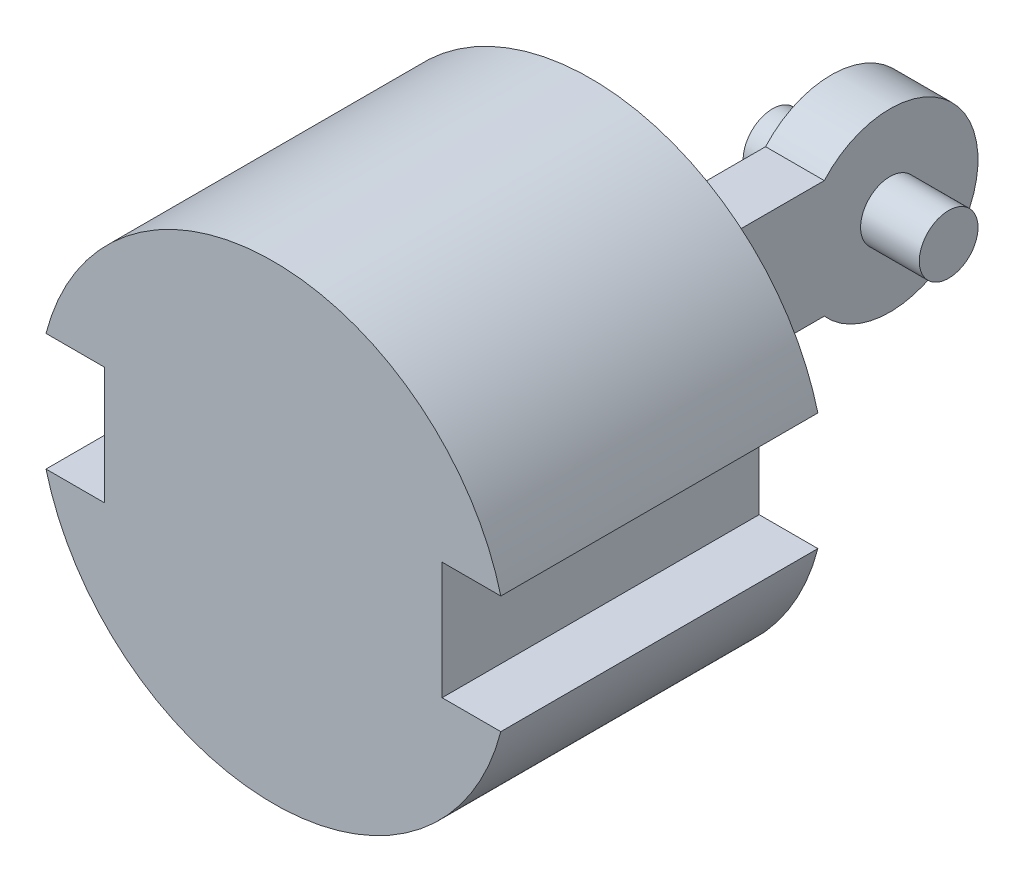
ISO-10303-21;
HEADER;
FILE_DESCRIPTION(('STEP AP214'),'2;1');
FILE_NAME('part.step','',(''),(''),'','','');
FILE_SCHEMA(('AUTOMOTIVE_DESIGN { 1 0 10303 214 1 1 1 1 }'));
ENDSEC;
DATA;
#1=APPLICATION_CONTEXT('core data for automotive mechanical design processes');
#2=APPLICATION_PROTOCOL_DEFINITION('international standard','automotive_design',2000,#1);
#3=PRODUCT_CONTEXT('',#1,'mechanical');
#4=PRODUCT('Part','Part','',(#3));
#5=PRODUCT_RELATED_PRODUCT_CATEGORY('part','',(#4));
#6=PRODUCT_DEFINITION_FORMATION('','',#4);
#7=PRODUCT_DEFINITION_CONTEXT('part definition',#1,'design');
#8=PRODUCT_DEFINITION('design','',#6,#7);
#9=PRODUCT_DEFINITION_SHAPE('','',#8);
#10=(LENGTH_UNIT() NAMED_UNIT(*) SI_UNIT(.MILLI.,.METRE.));
#11=(NAMED_UNIT(*) PLANE_ANGLE_UNIT() SI_UNIT($,.RADIAN.));
#12=(NAMED_UNIT(*) SI_UNIT($,.STERADIAN.) SOLID_ANGLE_UNIT());
#13=UNCERTAINTY_MEASURE_WITH_UNIT(LENGTH_MEASURE(1.E-05),#10,'distance_accuracy_value','');
#14=(GEOMETRIC_REPRESENTATION_CONTEXT(3) GLOBAL_UNCERTAINTY_ASSIGNED_CONTEXT((#13)) GLOBAL_UNIT_ASSIGNED_CONTEXT((#10,
#11,#12)) REPRESENTATION_CONTEXT('',''));
#15=CARTESIAN_POINT('',(0.,0.,0.));
#16=DIRECTION('',(0.,0.,1.));
#17=DIRECTION('',(1.,0.,0.));
#18=AXIS2_PLACEMENT_3D('',#15,#16,#17);
#19=CARTESIAN_POINT('',(0.,0.,68.58));
#20=DIRECTION('',(0.,0.,-1.));
#21=DIRECTION('',(-1.,0.,0.));
#22=AXIS2_PLACEMENT_3D('',#19,#20,#21);
#23=CYLINDRICAL_SURFACE('',#22,50.8);
#24=CARTESIAN_POINT('',(0.,0.,0.));
#25=DIRECTION('',(0.,0.,1.));
#26=DIRECTION('',(1.,0.,0.));
#27=AXIS2_PLACEMENT_3D('',#24,#25,#26);
#28=CIRCLE('',#27,50.8);
#29=CARTESIAN_POINT('',(49.1868884968342,12.7,0.));
#30=VERTEX_POINT('',#29);
#31=CARTESIAN_POINT('',(-49.1868884968342,12.7,0.));
#32=VERTEX_POINT('',#31);
#33=EDGE_CURVE('E140',#30,#32,#28,.T.);
#34=ORIENTED_EDGE('',*,*,#33,.T.);
#35=DIRECTION('',(0.,0.,-1.));
#36=VECTOR('',#35,1.);
#37=CARTESIAN_POINT('',(-49.1868884968342,12.7,68.58));
#38=LINE('',#37,#36);
#39=CARTESIAN_POINT('',(-49.1868884968342,12.7,68.58));
#40=VERTEX_POINT('',#39);
#41=EDGE_CURVE('E11',#40,#32,#38,.T.);
#42=ORIENTED_EDGE('',*,*,#41,.F.);
#43=CARTESIAN_POINT('',(0.,0.,68.58));
#44=DIRECTION('',(0.,0.,1.));
#45=DIRECTION('',(1.,0.,0.));
#46=AXIS2_PLACEMENT_3D('',#43,#44,#45);
#47=CIRCLE('',#46,50.8);
#48=CARTESIAN_POINT('',(49.1868884968342,12.7,68.58));
#49=VERTEX_POINT('',#48);
#50=EDGE_CURVE('E162',#49,#40,#47,.T.);
#51=ORIENTED_EDGE('',*,*,#50,.F.);
#52=DIRECTION('',(0.,0.,-1.));
#53=VECTOR('',#52,1.);
#54=CARTESIAN_POINT('',(49.1868884968342,12.7,68.58));
#55=LINE('',#54,#53);
#56=EDGE_CURVE('E180',#49,#30,#55,.T.);
#57=ORIENTED_EDGE('',*,*,#56,.T.);
#58=EDGE_LOOP('',(#34,#42,#51,#57));
#59=FACE_BOUND('',#58,.T.);
#60=ADVANCED_FACE('F34',(#59),#23,.T.);
#61=CARTESIAN_POINT('',(-49.1868884968342,12.7,68.58));
#62=DIRECTION('',(0.,1.,0.));
#63=DIRECTION('',(-1.,0.,0.));
#64=AXIS2_PLACEMENT_3D('',#61,#62,#63);
#65=PLANE('',#64);
#66=DIRECTION('',(1.,0.,0.));
#67=VECTOR('',#66,1.);
#68=CARTESIAN_POINT('',(-49.1868884968342,12.7,0.));
#69=LINE('',#68,#67);
#70=CARTESIAN_POINT('',(-36.4868884968342,12.7,0.));
#71=VERTEX_POINT('',#70);
#72=EDGE_CURVE('E183',#32,#71,#69,.T.);
#73=ORIENTED_EDGE('',*,*,#72,.T.);
#74=DIRECTION('',(0.,0.,-1.));
#75=VECTOR('',#74,1.);
#76=CARTESIAN_POINT('',(-36.4868884968342,12.7,68.58));
#77=LINE('',#76,#75);
#78=CARTESIAN_POINT('',(-36.4868884968342,12.7,68.58));
#79=VERTEX_POINT('',#78);
#80=EDGE_CURVE('E41',#79,#71,#77,.T.);
#81=ORIENTED_EDGE('',*,*,#80,.F.);
#82=DIRECTION('',(1.,0.,0.));
#83=VECTOR('',#82,1.);
#84=CARTESIAN_POINT('',(-49.1868884968342,12.7,68.58));
#85=LINE('',#84,#83);
#86=EDGE_CURVE('E165',#40,#79,#85,.T.);
#87=ORIENTED_EDGE('',*,*,#86,.F.);
#88=ORIENTED_EDGE('',*,*,#41,.T.);
#89=EDGE_LOOP('',(#73,#81,#87,#88));
#90=FACE_BOUND('',#89,.T.);
#91=ADVANCED_FACE('F240',(#90),#65,.F.);
#92=CARTESIAN_POINT('',(-36.4868884968342,12.7,68.58));
#93=DIRECTION('',(1.,0.,0.));
#94=DIRECTION('',(0.,0.,-1.));
#95=AXIS2_PLACEMENT_3D('',#92,#93,#94);
#96=PLANE('',#95);
#97=DIRECTION('',(0.,-1.,0.));
#98=VECTOR('',#97,1.);
#99=CARTESIAN_POINT('',(-36.4868884968342,12.7,0.));
#100=LINE('',#99,#98);
#101=CARTESIAN_POINT('',(-36.4868884968342,-12.7,0.));
#102=VERTEX_POINT('',#101);
#103=EDGE_CURVE('E185',#71,#102,#100,.T.);
#104=ORIENTED_EDGE('',*,*,#103,.T.);
#105=DIRECTION('',(0.,0.,-1.));
#106=VECTOR('',#105,1.);
#107=CARTESIAN_POINT('',(-36.4868884968342,-12.7,68.58));
#108=LINE('',#107,#106);
#109=CARTESIAN_POINT('',(-36.4868884968342,-12.7,68.58));
#110=VERTEX_POINT('',#109);
#111=EDGE_CURVE('E210',#110,#102,#108,.T.);
#112=ORIENTED_EDGE('',*,*,#111,.F.);
#113=DIRECTION('',(0.,-1.,0.));
#114=VECTOR('',#113,1.);
#115=CARTESIAN_POINT('',(-36.4868884968342,12.7,68.58));
#116=LINE('',#115,#114);
#117=EDGE_CURVE('E168',#79,#110,#116,.T.);
#118=ORIENTED_EDGE('',*,*,#117,.F.);
#119=ORIENTED_EDGE('',*,*,#80,.T.);
#120=EDGE_LOOP('',(#104,#112,#118,#119));
#121=FACE_BOUND('',#120,.T.);
#122=ADVANCED_FACE('F217',(#121),#96,.F.);
#123=CARTESIAN_POINT('',(-36.4868884968342,-12.7,68.58));
#124=DIRECTION('',(0.,-1.,0.));
#125=DIRECTION('',(1.,0.,0.));
#126=AXIS2_PLACEMENT_3D('',#123,#124,#125);
#127=PLANE('',#126);
#128=DIRECTION('',(-1.,0.,0.));
#129=VECTOR('',#128,1.);
#130=CARTESIAN_POINT('',(-36.4868884968342,-12.7,0.));
#131=LINE('',#130,#129);
#132=CARTESIAN_POINT('',(-49.1868884968342,-12.7,0.));
#133=VERTEX_POINT('',#132);
#134=EDGE_CURVE('E187',#102,#133,#131,.T.);
#135=ORIENTED_EDGE('',*,*,#134,.T.);
#136=DIRECTION('',(0.,0.,-1.));
#137=VECTOR('',#136,1.);
#138=CARTESIAN_POINT('',(-49.1868884968342,-12.7,68.58));
#139=LINE('',#138,#137);
#140=CARTESIAN_POINT('',(-49.1868884968342,-12.7,68.58));
#141=VERTEX_POINT('',#140);
#142=EDGE_CURVE('E207',#141,#133,#139,.T.);
#143=ORIENTED_EDGE('',*,*,#142,.F.);
#144=DIRECTION('',(-1.,0.,0.));
#145=VECTOR('',#144,1.);
#146=CARTESIAN_POINT('',(-36.4868884968342,-12.7,68.58));
#147=LINE('',#146,#145);
#148=EDGE_CURVE('E170',#110,#141,#147,.T.);
#149=ORIENTED_EDGE('',*,*,#148,.F.);
#150=ORIENTED_EDGE('',*,*,#111,.T.);
#151=EDGE_LOOP('',(#135,#143,#149,#150));
#152=FACE_BOUND('',#151,.T.);
#153=ADVANCED_FACE('F228',(#152),#127,.F.);
#154=CARTESIAN_POINT('',(0.,0.,68.58));
#155=DIRECTION('',(0.,0.,-1.));
#156=DIRECTION('',(-1.,0.,0.));
#157=AXIS2_PLACEMENT_3D('',#154,#155,#156);
#158=CYLINDRICAL_SURFACE('',#157,50.8);
#159=CARTESIAN_POINT('',(0.,0.,0.));
#160=DIRECTION('',(0.,0.,1.));
#161=DIRECTION('',(1.,0.,0.));
#162=AXIS2_PLACEMENT_3D('',#159,#160,#161);
#163=CIRCLE('',#162,50.8);
#164=CARTESIAN_POINT('',(49.1868884968342,-12.7,0.));
#165=VERTEX_POINT('',#164);
#166=EDGE_CURVE('E189',#133,#165,#163,.T.);
#167=ORIENTED_EDGE('',*,*,#166,.T.);
#168=DIRECTION('',(0.,0.,-1.));
#169=VECTOR('',#168,1.);
#170=CARTESIAN_POINT('',(49.1868884968342,-12.7,68.58));
#171=LINE('',#170,#169);
#172=CARTESIAN_POINT('',(49.1868884968342,-12.7,68.58));
#173=VERTEX_POINT('',#172);
#174=EDGE_CURVE('E204',#173,#165,#171,.T.);
#175=ORIENTED_EDGE('',*,*,#174,.F.);
#176=CARTESIAN_POINT('',(0.,0.,68.58));
#177=DIRECTION('',(0.,0.,1.));
#178=DIRECTION('',(1.,0.,0.));
#179=AXIS2_PLACEMENT_3D('',#176,#177,#178);
#180=CIRCLE('',#179,50.8);
#181=EDGE_CURVE('E172',#141,#173,#180,.T.);
#182=ORIENTED_EDGE('',*,*,#181,.F.);
#183=ORIENTED_EDGE('',*,*,#142,.T.);
#184=EDGE_LOOP('',(#167,#175,#182,#183));
#185=FACE_BOUND('',#184,.T.);
#186=ADVANCED_FACE('F232',(#185),#158,.T.);
#187=CARTESIAN_POINT('',(36.4868884968342,-12.7,68.58));
#188=DIRECTION('',(0.,-1.,0.));
#189=DIRECTION('',(1.,0.,0.));
#190=AXIS2_PLACEMENT_3D('',#187,#188,#189);
#191=PLANE('',#190);
#192=DIRECTION('',(-1.,0.,0.));
#193=VECTOR('',#192,1.);
#194=CARTESIAN_POINT('',(36.4868884968342,-12.7,0.));
#195=LINE('',#194,#193);
#196=CARTESIAN_POINT('',(36.4868884968342,-12.7,0.));
#197=VERTEX_POINT('',#196);
#198=EDGE_CURVE('E191',#165,#197,#195,.T.);
#199=ORIENTED_EDGE('',*,*,#198,.T.);
#200=DIRECTION('',(0.,0.,-1.));
#201=VECTOR('',#200,1.);
#202=CARTESIAN_POINT('',(36.4868884968342,-12.7,68.58));
#203=LINE('',#202,#201);
#204=CARTESIAN_POINT('',(36.4868884968342,-12.7,68.58));
#205=VERTEX_POINT('',#204);
#206=EDGE_CURVE('E201',#205,#197,#203,.T.);
#207=ORIENTED_EDGE('',*,*,#206,.F.);
#208=DIRECTION('',(-1.,0.,0.));
#209=VECTOR('',#208,1.);
#210=CARTESIAN_POINT('',(36.4868884968342,-12.7,68.58));
#211=LINE('',#210,#209);
#212=EDGE_CURVE('E174',#173,#205,#211,.T.);
#213=ORIENTED_EDGE('',*,*,#212,.F.);
#214=ORIENTED_EDGE('',*,*,#174,.T.);
#215=EDGE_LOOP('',(#199,#207,#213,#214));
#216=FACE_BOUND('',#215,.T.);
#217=ADVANCED_FACE('F253',(#216),#191,.F.);
#218=CARTESIAN_POINT('',(36.4868884968342,12.7,68.58));
#219=DIRECTION('',(-1.,0.,0.));
#220=DIRECTION('',(0.,0.,1.));
#221=AXIS2_PLACEMENT_3D('',#218,#219,#220);
#222=PLANE('',#221);
#223=DIRECTION('',(0.,1.,0.));
#224=VECTOR('',#223,1.);
#225=CARTESIAN_POINT('',(36.4868884968342,12.7,0.));
#226=LINE('',#225,#224);
#227=CARTESIAN_POINT('',(36.4868884968342,12.7,0.));
#228=VERTEX_POINT('',#227);
#229=EDGE_CURVE('E193',#197,#228,#226,.T.);
#230=ORIENTED_EDGE('',*,*,#229,.T.);
#231=DIRECTION('',(0.,0.,-1.));
#232=VECTOR('',#231,1.);
#233=CARTESIAN_POINT('',(36.4868884968342,12.7,68.58));
#234=LINE('',#233,#232);
#235=CARTESIAN_POINT('',(36.4868884968342,12.7,68.58));
#236=VERTEX_POINT('',#235);
#237=EDGE_CURVE('E198',#236,#228,#234,.T.);
#238=ORIENTED_EDGE('',*,*,#237,.F.);
#239=DIRECTION('',(0.,1.,0.));
#240=VECTOR('',#239,1.);
#241=CARTESIAN_POINT('',(36.4868884968342,12.7,68.58));
#242=LINE('',#241,#240);
#243=EDGE_CURVE('E176',#205,#236,#242,.T.);
#244=ORIENTED_EDGE('',*,*,#243,.F.);
#245=ORIENTED_EDGE('',*,*,#206,.T.);
#246=EDGE_LOOP('',(#230,#238,#244,#245));
#247=FACE_BOUND('',#246,.T.);
#248=ADVANCED_FACE('F251',(#247),#222,.F.);
#249=CARTESIAN_POINT('',(49.1868884968342,12.7,68.58));
#250=DIRECTION('',(0.,1.,0.));
#251=DIRECTION('',(-1.,0.,0.));
#252=AXIS2_PLACEMENT_3D('',#249,#250,#251);
#253=PLANE('',#252);
#254=DIRECTION('',(1.,0.,0.));
#255=VECTOR('',#254,1.);
#256=CARTESIAN_POINT('',(49.1868884968342,12.7,0.));
#257=LINE('',#256,#255);
#258=EDGE_CURVE('E166',#228,#30,#257,.T.);
#259=ORIENTED_EDGE('',*,*,#258,.T.);
#260=ORIENTED_EDGE('',*,*,#56,.F.);
#261=DIRECTION('',(1.,0.,0.));
#262=VECTOR('',#261,1.);
#263=CARTESIAN_POINT('',(49.1868884968342,12.7,68.58));
#264=LINE('',#263,#262);
#265=EDGE_CURVE('E178',#236,#49,#264,.T.);
#266=ORIENTED_EDGE('',*,*,#265,.F.);
#267=ORIENTED_EDGE('',*,*,#237,.T.);
#268=EDGE_LOOP('',(#259,#260,#266,#267));
#269=FACE_BOUND('',#268,.T.);
#270=ADVANCED_FACE('F246',(#269),#253,.F.);
#271=CARTESIAN_POINT('',(0.,0.,68.58));
#272=DIRECTION('',(0.,0.,1.));
#273=DIRECTION('',(1.,0.,0.));
#274=AXIS2_PLACEMENT_3D('',#271,#272,#273);
#275=PLANE('',#274);
#276=ORIENTED_EDGE('',*,*,#50,.T.);
#277=ORIENTED_EDGE('',*,*,#86,.T.);
#278=ORIENTED_EDGE('',*,*,#117,.T.);
#279=ORIENTED_EDGE('',*,*,#148,.T.);
#280=ORIENTED_EDGE('',*,*,#181,.T.);
#281=ORIENTED_EDGE('',*,*,#212,.T.);
#282=ORIENTED_EDGE('',*,*,#243,.T.);
#283=ORIENTED_EDGE('',*,*,#265,.T.);
#284=EDGE_LOOP('',(#276,#277,#278,#279,#280,#281,#282,#283));
#285=FACE_BOUND('',#284,.T.);
#286=ADVANCED_FACE('F236',(#285),#275,.T.);
#287=CARTESIAN_POINT('',(0.,0.,0.));
#288=DIRECTION('',(0.,0.,1.));
#289=DIRECTION('',(1.,0.,0.));
#290=AXIS2_PLACEMENT_3D('',#287,#288,#289);
#291=PLANE('',#290);
#292=DIRECTION('',(-1.,0.,0.));
#293=VECTOR('',#292,1.);
#294=CARTESIAN_POINT('',(6.35,-12.7,0.));
#295=LINE('',#294,#293);
#296=CARTESIAN_POINT('',(6.35,-12.7,0.));
#297=VERTEX_POINT('',#296);
#298=CARTESIAN_POINT('',(-6.35,-12.7,0.));
#299=VERTEX_POINT('',#298);
#300=EDGE_CURVE('E53',#297,#299,#295,.T.);
#301=ORIENTED_EDGE('',*,*,#300,.F.);
#302=DIRECTION('',(0.,1.,0.));
#303=VECTOR('',#302,1.);
#304=CARTESIAN_POINT('',(6.35,0.,0.));
#305=LINE('',#304,#303);
#306=CARTESIAN_POINT('',(6.35,12.7,0.));
#307=VERTEX_POINT('',#306);
#308=EDGE_CURVE('E48',#297,#307,#305,.T.);
#309=ORIENTED_EDGE('',*,*,#308,.T.);
#310=DIRECTION('',(-1.,0.,0.));
#311=VECTOR('',#310,1.);
#312=CARTESIAN_POINT('',(6.35,12.7,0.));
#313=LINE('',#312,#311);
#314=CARTESIAN_POINT('',(-6.35,12.7,0.));
#315=VERTEX_POINT('',#314);
#316=EDGE_CURVE('E141',#307,#315,#313,.T.);
#317=ORIENTED_EDGE('',*,*,#316,.T.);
#318=DIRECTION('',(0.,1.,0.));
#319=VECTOR('',#318,1.);
#320=CARTESIAN_POINT('',(-6.35,0.,0.));
#321=LINE('',#320,#319);
#322=EDGE_CURVE('E154',#299,#315,#321,.T.);
#323=ORIENTED_EDGE('',*,*,#322,.F.);
#324=EDGE_LOOP('',(#301,#309,#317,#323));
#325=FACE_BOUND('',#324,.T.);
#326=ORIENTED_EDGE('',*,*,#33,.F.);
#327=ORIENTED_EDGE('',*,*,#258,.F.);
#328=ORIENTED_EDGE('',*,*,#229,.F.);
#329=ORIENTED_EDGE('',*,*,#198,.F.);
#330=ORIENTED_EDGE('',*,*,#166,.F.);
#331=ORIENTED_EDGE('',*,*,#134,.F.);
#332=ORIENTED_EDGE('',*,*,#103,.F.);
#333=ORIENTED_EDGE('',*,*,#72,.F.);
#334=EDGE_LOOP('',(#326,#327,#328,#329,#330,#331,#332,#333));
#335=FACE_BOUND('',#334,.T.);
#336=ADVANCED_FACE('F223',(#325,#335),#291,.F.);
#337=CARTESIAN_POINT('',(6.35,0.,-58.42));
#338=DIRECTION('',(-1.,0.,0.));
#339=DIRECTION('',(0.,0.,1.));
#340=AXIS2_PLACEMENT_3D('',#337,#338,#339);
#341=CYLINDRICAL_SURFACE('',#340,19.05);
#342=CARTESIAN_POINT('',(-6.35,0.,-58.42));
#343=DIRECTION('',(1.,0.,0.));
#344=DIRECTION('',(0.,0.,-1.));
#345=AXIS2_PLACEMENT_3D('',#342,#343,#344);
#346=CIRCLE('',#345,19.05);
#347=CARTESIAN_POINT('',(-6.35,-12.7,-44.2209683428764));
#348=VERTEX_POINT('',#347);
#349=CARTESIAN_POINT('',(-6.35,12.7,-44.2209683428764));
#350=VERTEX_POINT('',#349);
#351=EDGE_CURVE('E136',#348,#350,#346,.T.);
#352=ORIENTED_EDGE('',*,*,#351,.T.);
#353=DIRECTION('',(-1.,0.,0.));
#354=VECTOR('',#353,1.);
#355=CARTESIAN_POINT('',(6.35,12.7,-44.2209683428764));
#356=LINE('',#355,#354);
#357=CARTESIAN_POINT('',(6.35,12.7,-44.2209683428764));
#358=VERTEX_POINT('',#357);
#359=EDGE_CURVE('E133',#358,#350,#356,.T.);
#360=ORIENTED_EDGE('',*,*,#359,.F.);
#361=CARTESIAN_POINT('',(6.35,0.,-58.42));
#362=DIRECTION('',(1.,0.,0.));
#363=DIRECTION('',(0.,0.,-1.));
#364=AXIS2_PLACEMENT_3D('',#361,#362,#363);
#365=CIRCLE('',#364,19.05);
#366=CARTESIAN_POINT('',(6.35,-12.7,-44.2209683428764));
#367=VERTEX_POINT('',#366);
#368=EDGE_CURVE('E121',#367,#358,#365,.T.);
#369=ORIENTED_EDGE('',*,*,#368,.F.);
#370=DIRECTION('',(-1.,0.,0.));
#371=VECTOR('',#370,1.);
#372=CARTESIAN_POINT('',(6.35,-12.7,-44.2209683428764));
#373=LINE('',#372,#371);
#374=EDGE_CURVE('E149',#367,#348,#373,.T.);
#375=ORIENTED_EDGE('',*,*,#374,.T.);
#376=EDGE_LOOP('',(#352,#360,#369,#375));
#377=FACE_BOUND('',#376,.T.);
#378=ADVANCED_FACE('F134',(#377),#341,.T.);
#379=CARTESIAN_POINT('',(6.35,12.7,0.));
#380=DIRECTION('',(0.,1.,0.));
#381=DIRECTION('',(0.,0.,1.));
#382=AXIS2_PLACEMENT_3D('',#379,#380,#381);
#383=PLANE('',#382);
#384=DIRECTION('',(0.,0.,-1.));
#385=VECTOR('',#384,1.);
#386=CARTESIAN_POINT('',(-6.35,12.7,0.));
#387=LINE('',#386,#385);
#388=EDGE_CURVE('E151',#315,#350,#387,.T.);
#389=ORIENTED_EDGE('',*,*,#388,.F.);
#390=ORIENTED_EDGE('',*,*,#316,.F.);
#391=DIRECTION('',(0.,0.,-1.));
#392=VECTOR('',#391,1.);
#393=CARTESIAN_POINT('',(6.35,12.7,0.));
#394=LINE('',#393,#392);
#395=EDGE_CURVE('E125',#307,#358,#394,.T.);
#396=ORIENTED_EDGE('',*,*,#395,.T.);
#397=ORIENTED_EDGE('',*,*,#359,.T.);
#398=EDGE_LOOP('',(#389,#390,#396,#397));
#399=FACE_BOUND('',#398,.T.);
#400=ADVANCED_FACE('F143',(#399),#383,.T.);
#401=CARTESIAN_POINT('',(6.35,-12.7,0.));
#402=DIRECTION('',(0.,1.,0.));
#403=DIRECTION('',(0.,0.,1.));
#404=AXIS2_PLACEMENT_3D('',#401,#402,#403);
#405=PLANE('',#404);
#406=DIRECTION('',(0.,0.,-1.));
#407=VECTOR('',#406,1.);
#408=CARTESIAN_POINT('',(-6.35,-12.7,0.));
#409=LINE('',#408,#407);
#410=EDGE_CURVE('E157',#299,#348,#409,.T.);
#411=ORIENTED_EDGE('',*,*,#410,.T.);
#412=ORIENTED_EDGE('',*,*,#374,.F.);
#413=DIRECTION('',(0.,0.,-1.));
#414=VECTOR('',#413,1.);
#415=CARTESIAN_POINT('',(6.35,-12.7,0.));
#416=LINE('',#415,#414);
#417=EDGE_CURVE('E126',#297,#367,#416,.T.);
#418=ORIENTED_EDGE('',*,*,#417,.F.);
#419=ORIENTED_EDGE('',*,*,#300,.T.);
#420=EDGE_LOOP('',(#411,#412,#418,#419));
#421=FACE_BOUND('',#420,.T.);
#422=ADVANCED_FACE('F331',(#421),#405,.F.);
#423=CARTESIAN_POINT('',(6.35,0.,0.));
#424=DIRECTION('',(1.,0.,0.));
#425=DIRECTION('',(0.,0.,-1.));
#426=AXIS2_PLACEMENT_3D('',#423,#424,#425);
#427=PLANE('',#426);
#428=CARTESIAN_POINT('',(6.35,0.,-58.42));
#429=DIRECTION('',(1.,0.,0.));
#430=DIRECTION('',(0.,0.,-1.));
#431=AXIS2_PLACEMENT_3D('',#428,#429,#430);
#432=CIRCLE('',#431,6.35);
#433=CARTESIAN_POINT('',(6.35,0.,-64.77));
#434=VERTEX_POINT('',#433);
#435=EDGE_CURVE('E130',#434,#434,#432,.T.);
#436=ORIENTED_EDGE('',*,*,#435,.F.);
#437=EDGE_LOOP('',(#436));
#438=FACE_BOUND('',#437,.T.);
#439=ORIENTED_EDGE('',*,*,#368,.T.);
#440=ORIENTED_EDGE('',*,*,#395,.F.);
#441=ORIENTED_EDGE('',*,*,#308,.F.);
#442=ORIENTED_EDGE('',*,*,#417,.T.);
#443=EDGE_LOOP('',(#439,#440,#441,#442));
#444=FACE_BOUND('',#443,.T.);
#445=ADVANCED_FACE('F123',(#438,#444),#427,.T.);
#446=CARTESIAN_POINT('',(-6.35,0.,0.));
#447=DIRECTION('',(1.,0.,0.));
#448=DIRECTION('',(0.,0.,-1.));
#449=AXIS2_PLACEMENT_3D('',#446,#447,#448);
#450=PLANE('',#449);
#451=CARTESIAN_POINT('',(-6.35,0.,-58.42));
#452=DIRECTION('',(1.,0.,0.));
#453=DIRECTION('',(0.,0.,-1.));
#454=AXIS2_PLACEMENT_3D('',#451,#452,#453);
#455=CIRCLE('',#454,6.35);
#456=CARTESIAN_POINT('',(-6.35,0.,-64.77));
#457=VERTEX_POINT('',#456);
#458=EDGE_CURVE('E152',#457,#457,#455,.F.);
#459=ORIENTED_EDGE('',*,*,#458,.F.);
#460=EDGE_LOOP('',(#459));
#461=FACE_BOUND('',#460,.T.);
#462=ORIENTED_EDGE('',*,*,#351,.F.);
#463=ORIENTED_EDGE('',*,*,#410,.F.);
#464=ORIENTED_EDGE('',*,*,#322,.T.);
#465=ORIENTED_EDGE('',*,*,#388,.T.);
#466=EDGE_LOOP('',(#462,#463,#464,#465));
#467=FACE_BOUND('',#466,.T.);
#468=ADVANCED_FACE('F350',(#461,#467),#450,.F.);
#469=CARTESIAN_POINT('',(-19.05,0.,0.));
#470=DIRECTION('',(1.,0.,0.));
#471=DIRECTION('',(0.,0.,-1.));
#472=AXIS2_PLACEMENT_3D('',#469,#470,#471);
#473=PLANE('',#472);
#474=CARTESIAN_POINT('',(-19.05,0.,-58.42));
#475=DIRECTION('',(1.,0.,0.));
#476=DIRECTION('',(0.,0.,-1.));
#477=AXIS2_PLACEMENT_3D('',#474,#475,#476);
#478=CIRCLE('',#477,6.35);
#479=CARTESIAN_POINT('',(-19.05,0.,-64.77));
#480=VERTEX_POINT('',#479);
#481=EDGE_CURVE('E408',#480,#480,#478,.T.);
#482=ORIENTED_EDGE('',*,*,#481,.F.);
#483=EDGE_LOOP('',(#482));
#484=FACE_BOUND('',#483,.T.);
#485=ADVANCED_FACE('F361',(#484),#473,.F.);
#486=CARTESIAN_POINT('',(19.05,0.,-58.42));
#487=DIRECTION('',(-1.,0.,0.));
#488=DIRECTION('',(0.,0.,1.));
#489=AXIS2_PLACEMENT_3D('',#486,#487,#488);
#490=CYLINDRICAL_SURFACE('',#489,6.35);
#491=ORIENTED_EDGE('',*,*,#481,.T.);
#492=EDGE_LOOP('',(#491));
#493=FACE_BOUND('',#492,.T.);
#494=ORIENTED_EDGE('',*,*,#458,.T.);
#495=EDGE_LOOP('',(#494));
#496=FACE_BOUND('',#495,.T.);
#497=ADVANCED_FACE('F371',(#493,#496),#490,.T.);
#498=ORIENTED_EDGE('',*,*,#435,.T.);
#499=EDGE_LOOP('',(#498));
#500=FACE_BOUND('',#499,.T.);
#501=CARTESIAN_POINT('',(19.05,0.,-58.42));
#502=DIRECTION('',(1.,0.,0.));
#503=DIRECTION('',(0.,0.,-1.));
#504=AXIS2_PLACEMENT_3D('',#501,#502,#503);
#505=CIRCLE('',#504,6.35);
#506=CARTESIAN_POINT('',(19.05,0.,-64.77));
#507=VERTEX_POINT('',#506);
#508=EDGE_CURVE('E406',#507,#507,#505,.T.);
#509=ORIENTED_EDGE('',*,*,#508,.F.);
#510=EDGE_LOOP('',(#509));
#511=FACE_BOUND('',#510,.T.);
#512=ADVANCED_FACE('F381',(#500,#511),#490,.T.);
#513=CARTESIAN_POINT('',(19.05,0.,0.));
#514=DIRECTION('',(1.,0.,0.));
#515=DIRECTION('',(0.,0.,-1.));
#516=AXIS2_PLACEMENT_3D('',#513,#514,#515);
#517=PLANE('',#516);
#518=ORIENTED_EDGE('',*,*,#508,.T.);
#519=EDGE_LOOP('',(#518));
#520=FACE_BOUND('',#519,.T.);
#521=ADVANCED_FACE('F391',(#520),#517,.T.);
#522=CLOSED_SHELL('',(#60,#91,#122,#153,#186,#217,#248,#270,#286,#336,#378,#400,#422,#445,#468,
#485,#497,#512,#521));
#523=MANIFOLD_SOLID_BREP('B2',#522);
#524=ADVANCED_BREP_SHAPE_REPRESENTATION('',(#18,#523),#14);
#525=SHAPE_DEFINITION_REPRESENTATION(#9,#524);
ENDSEC;
END-ISO-10303-21;
